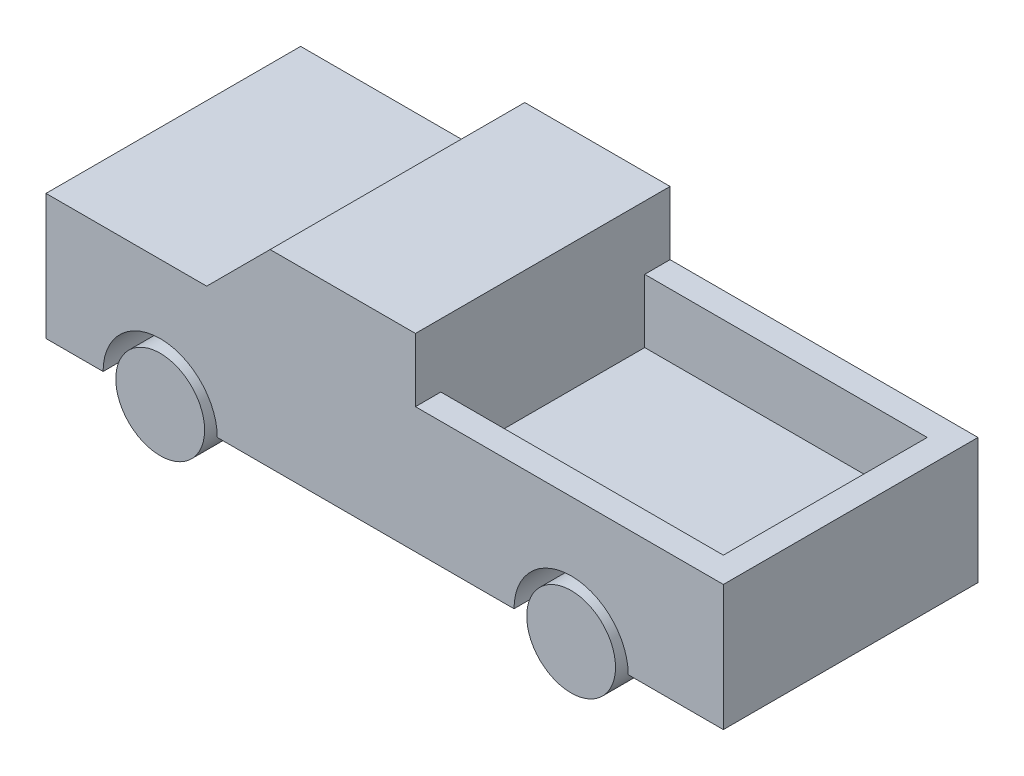
ISO-10303-21;
HEADER;
FILE_DESCRIPTION(('STEP AP214'),'2;1');
FILE_NAME('part.step','',(''),(''),'','','');
FILE_SCHEMA(('AUTOMOTIVE_DESIGN { 1 0 10303 214 1 1 1 1 }'));
ENDSEC;
DATA;
#1=APPLICATION_CONTEXT('core data for automotive mechanical design processes');
#2=APPLICATION_PROTOCOL_DEFINITION('international standard','automotive_design',2000,#1);
#3=PRODUCT_CONTEXT('',#1,'mechanical');
#4=PRODUCT('Part','Part','',(#3));
#5=PRODUCT_RELATED_PRODUCT_CATEGORY('part','',(#4));
#6=PRODUCT_DEFINITION_FORMATION('','',#4);
#7=PRODUCT_DEFINITION_CONTEXT('part definition',#1,'design');
#8=PRODUCT_DEFINITION('design','',#6,#7);
#9=PRODUCT_DEFINITION_SHAPE('','',#8);
#10=(LENGTH_UNIT() NAMED_UNIT(*) SI_UNIT(.MILLI.,.METRE.));
#11=(NAMED_UNIT(*) PLANE_ANGLE_UNIT() SI_UNIT($,.RADIAN.));
#12=(NAMED_UNIT(*) SI_UNIT($,.STERADIAN.) SOLID_ANGLE_UNIT());
#13=UNCERTAINTY_MEASURE_WITH_UNIT(LENGTH_MEASURE(1.E-05),#10,'distance_accuracy_value','');
#14=(GEOMETRIC_REPRESENTATION_CONTEXT(3) GLOBAL_UNCERTAINTY_ASSIGNED_CONTEXT((#13)) GLOBAL_UNIT_ASSIGNED_CONTEXT((#10,
#11,#12)) REPRESENTATION_CONTEXT('',''));
#15=CARTESIAN_POINT('',(0.,0.,0.));
#16=DIRECTION('',(0.,0.,1.));
#17=DIRECTION('',(1.,0.,0.));
#18=AXIS2_PLACEMENT_3D('',#15,#16,#17);
#19=CARTESIAN_POINT('',(4139.,-1491.,2007.));
#20=DIRECTION('',(0.,0.,-1.));
#21=DIRECTION('',(-1.,0.,0.));
#22=AXIS2_PLACEMENT_3D('',#19,#20,#21);
#23=CYLINDRICAL_SURFACE('',#22,349.999999999999);
#24=CARTESIAN_POINT('',(4139.,-1491.,2007.));
#25=DIRECTION('',(0.,0.,1.));
#26=DIRECTION('',(1.,0.,0.));
#27=AXIS2_PLACEMENT_3D('',#24,#25,#26);
#28=CIRCLE('',#27,349.999999999999);
#29=CARTESIAN_POINT('',(4489.,-1491.,2007.));
#30=VERTEX_POINT('',#29);
#31=EDGE_CURVE('E12',#30,#30,#28,.T.);
#32=ORIENTED_EDGE('',*,*,#31,.F.);
#33=EDGE_LOOP('',(#32));
#34=FACE_BOUND('',#33,.T.);
#35=CARTESIAN_POINT('',(4139.,-1491.,0.));
#36=DIRECTION('',(0.,0.,1.));
#37=DIRECTION('',(1.,0.,0.));
#38=AXIS2_PLACEMENT_3D('',#35,#36,#37);
#39=CIRCLE('',#38,349.999999999999);
#40=CARTESIAN_POINT('',(4489.,-1491.,0.));
#41=VERTEX_POINT('',#40);
#42=EDGE_CURVE('E129',#41,#41,#39,.T.);
#43=ORIENTED_EDGE('',*,*,#42,.T.);
#44=EDGE_LOOP('',(#43));
#45=FACE_BOUND('',#44,.T.);
#46=ADVANCED_FACE('F126',(#34,#45),#23,.T.);
#47=CARTESIAN_POINT('',(0.,0.,2007.));
#48=DIRECTION('',(0.,0.,1.));
#49=DIRECTION('',(1.,0.,0.));
#50=AXIS2_PLACEMENT_3D('',#47,#48,#49);
#51=PLANE('',#50);
#52=ORIENTED_EDGE('',*,*,#31,.T.);
#53=EDGE_LOOP('',(#52));
#54=FACE_BOUND('',#53,.T.);
#55=ADVANCED_FACE('F141',(#54),#51,.T.);
#56=CARTESIAN_POINT('',(0.,0.,0.));
#57=DIRECTION('',(0.,0.,1.));
#58=DIRECTION('',(1.,0.,0.));
#59=AXIS2_PLACEMENT_3D('',#56,#57,#58);
#60=PLANE('',#59);
#61=ORIENTED_EDGE('',*,*,#42,.F.);
#62=EDGE_LOOP('',(#61));
#63=FACE_BOUND('',#62,.T.);
#64=ADVANCED_FACE('F139',(#63),#60,.F.);
#65=CLOSED_SHELL('',(#46,#55,#64));
#66=MANIFOLD_SOLID_BREP('B2',#65);
#67=CARTESIAN_POINT('',(900.,-1491.,2007.));
#68=DIRECTION('',(0.,0.,-1.));
#69=DIRECTION('',(-1.,0.,0.));
#70=AXIS2_PLACEMENT_3D('',#67,#68,#69);
#71=CYLINDRICAL_SURFACE('',#70,350.);
#72=CARTESIAN_POINT('',(900.,-1491.,2007.));
#73=DIRECTION('',(0.,0.,1.));
#74=DIRECTION('',(1.,0.,0.));
#75=AXIS2_PLACEMENT_3D('',#72,#73,#74);
#76=CIRCLE('',#75,350.);
#77=CARTESIAN_POINT('',(1250.,-1491.,2007.));
#78=VERTEX_POINT('',#77);
#79=EDGE_CURVE('E125',#78,#78,#76,.T.);
#80=ORIENTED_EDGE('',*,*,#79,.F.);
#81=EDGE_LOOP('',(#80));
#82=FACE_BOUND('',#81,.T.);
#83=CARTESIAN_POINT('',(900.,-1491.,0.));
#84=DIRECTION('',(0.,0.,1.));
#85=DIRECTION('',(1.,0.,0.));
#86=AXIS2_PLACEMENT_3D('',#83,#84,#85);
#87=CIRCLE('',#86,350.);
#88=CARTESIAN_POINT('',(1250.,-1491.,0.));
#89=VERTEX_POINT('',#88);
#90=EDGE_CURVE('E179',#89,#89,#87,.T.);
#91=ORIENTED_EDGE('',*,*,#90,.T.);
#92=EDGE_LOOP('',(#91));
#93=FACE_BOUND('',#92,.T.);
#94=ADVANCED_FACE('F176',(#82,#93),#71,.T.);
#95=CARTESIAN_POINT('',(0.,0.,2007.));
#96=DIRECTION('',(0.,0.,1.));
#97=DIRECTION('',(1.,0.,0.));
#98=AXIS2_PLACEMENT_3D('',#95,#96,#97);
#99=PLANE('',#98);
#100=ORIENTED_EDGE('',*,*,#79,.T.);
#101=EDGE_LOOP('',(#100));
#102=FACE_BOUND('',#101,.T.);
#103=ADVANCED_FACE('F191',(#102),#99,.T.);
#104=CARTESIAN_POINT('',(0.,0.,0.));
#105=DIRECTION('',(0.,0.,1.));
#106=DIRECTION('',(1.,0.,0.));
#107=AXIS2_PLACEMENT_3D('',#104,#105,#106);
#108=PLANE('',#107);
#109=ORIENTED_EDGE('',*,*,#90,.F.);
#110=EDGE_LOOP('',(#109));
#111=FACE_BOUND('',#110,.T.);
#112=ADVANCED_FACE('F189',(#111),#108,.F.);
#113=CLOSED_SHELL('',(#94,#103,#112));
#114=MANIFOLD_SOLID_BREP('B7',#113);
#115=CARTESIAN_POINT('',(4139.,-1491.,2007.));
#116=DIRECTION('',(0.,0.,-1.));
#117=DIRECTION('',(-1.,0.,0.));
#118=AXIS2_PLACEMENT_3D('',#115,#116,#117);
#119=CYLINDRICAL_SURFACE('',#118,450.);
#120=CARTESIAN_POINT('',(4139.,-1491.,0.));
#121=DIRECTION('',(0.,0.,1.));
#122=DIRECTION('',(1.,0.,0.));
#123=AXIS2_PLACEMENT_3D('',#120,#121,#122);
#124=CIRCLE('',#123,450.);
#125=CARTESIAN_POINT('',(4589.,-1491.,0.));
#126=VERTEX_POINT('',#125);
#127=CARTESIAN_POINT('',(3689.,-1491.,0.));
#128=VERTEX_POINT('',#127);
#129=EDGE_CURVE('E352',#126,#128,#124,.T.);
#130=ORIENTED_EDGE('',*,*,#129,.F.);
#131=DIRECTION('',(0.,0.,-1.));
#132=VECTOR('',#131,1.);
#133=CARTESIAN_POINT('',(4589.,-1491.,2007.));
#134=LINE('',#133,#132);
#135=CARTESIAN_POINT('',(4589.,-1491.,2007.));
#136=VERTEX_POINT('',#135);
#137=EDGE_CURVE('E174',#136,#126,#134,.T.);
#138=ORIENTED_EDGE('',*,*,#137,.F.);
#139=CARTESIAN_POINT('',(4139.,-1491.,2007.));
#140=DIRECTION('',(0.,0.,1.));
#141=DIRECTION('',(1.,0.,0.));
#142=AXIS2_PLACEMENT_3D('',#139,#140,#141);
#143=CIRCLE('',#142,450.);
#144=CARTESIAN_POINT('',(3689.,-1491.,2007.));
#145=VERTEX_POINT('',#144);
#146=EDGE_CURVE('E396',#136,#145,#143,.T.);
#147=ORIENTED_EDGE('',*,*,#146,.T.);
#148=DIRECTION('',(0.,0.,-1.));
#149=VECTOR('',#148,1.);
#150=CARTESIAN_POINT('',(3689.,-1491.,2007.));
#151=LINE('',#150,#149);
#152=EDGE_CURVE('E286',#145,#128,#151,.T.);
#153=ORIENTED_EDGE('',*,*,#152,.T.);
#154=EDGE_LOOP('',(#130,#138,#147,#153));
#155=FACE_BOUND('',#154,.T.);
#156=ADVANCED_FACE('F217',(#155),#119,.F.);
#157=CARTESIAN_POINT('',(0.,-1491.,2007.));
#158=DIRECTION('',(0.,1.,0.));
#159=DIRECTION('',(0.,0.,1.));
#160=AXIS2_PLACEMENT_3D('',#157,#158,#159);
#161=PLANE('',#160);
#162=DIRECTION('',(1.,0.,0.));
#163=VECTOR('',#162,1.);
#164=CARTESIAN_POINT('',(0.,-1491.,0.));
#165=LINE('',#164,#163);
#166=CARTESIAN_POINT('',(5339.,-1491.,0.));
#167=VERTEX_POINT('',#166);
#168=EDGE_CURVE('E356',#126,#167,#165,.T.);
#169=ORIENTED_EDGE('',*,*,#168,.T.);
#170=DIRECTION('',(0.,0.,-1.));
#171=VECTOR('',#170,1.);
#172=CARTESIAN_POINT('',(5339.,-1491.,2007.));
#173=LINE('',#172,#171);
#174=CARTESIAN_POINT('',(5339.,-1491.,2007.));
#175=VERTEX_POINT('',#174);
#176=EDGE_CURVE('E225',#175,#167,#173,.T.);
#177=ORIENTED_EDGE('',*,*,#176,.F.);
#178=DIRECTION('',(1.,0.,0.));
#179=VECTOR('',#178,1.);
#180=CARTESIAN_POINT('',(0.,-1491.,2007.));
#181=LINE('',#180,#179);
#182=EDGE_CURVE('E445',#136,#175,#181,.T.);
#183=ORIENTED_EDGE('',*,*,#182,.F.);
#184=ORIENTED_EDGE('',*,*,#137,.T.);
#185=EDGE_LOOP('',(#169,#177,#183,#184));
#186=FACE_BOUND('',#185,.T.);
#187=ADVANCED_FACE('F432',(#186),#161,.F.);
#188=CARTESIAN_POINT('',(5339.,0.,2007.));
#189=DIRECTION('',(1.,0.,0.));
#190=DIRECTION('',(0.,0.,-1.));
#191=AXIS2_PLACEMENT_3D('',#188,#189,#190);
#192=PLANE('',#191);
#193=DIRECTION('',(0.,-1.,0.));
#194=VECTOR('',#193,1.);
#195=CARTESIAN_POINT('',(5339.,0.,0.));
#196=LINE('',#195,#194);
#197=CARTESIAN_POINT('',(5339.,-500.,0.));
#198=VERTEX_POINT('',#197);
#199=EDGE_CURVE('E361',#198,#167,#196,.T.);
#200=ORIENTED_EDGE('',*,*,#199,.F.);
#201=DIRECTION('',(0.,0.,-1.));
#202=VECTOR('',#201,1.);
#203=CARTESIAN_POINT('',(5339.,-500.,2007.));
#204=LINE('',#203,#202);
#205=CARTESIAN_POINT('',(5339.,-500.,2007.));
#206=VERTEX_POINT('',#205);
#207=EDGE_CURVE('E420',#206,#198,#204,.T.);
#208=ORIENTED_EDGE('',*,*,#207,.F.);
#209=DIRECTION('',(0.,-1.,0.));
#210=VECTOR('',#209,1.);
#211=CARTESIAN_POINT('',(5339.,0.,2007.));
#212=LINE('',#211,#210);
#213=EDGE_CURVE('E429',#206,#175,#212,.T.);
#214=ORIENTED_EDGE('',*,*,#213,.T.);
#215=ORIENTED_EDGE('',*,*,#176,.T.);
#216=EDGE_LOOP('',(#200,#208,#214,#215));
#217=FACE_BOUND('',#216,.T.);
#218=ADVANCED_FACE('F427',(#217),#192,.T.);
#219=CARTESIAN_POINT('',(0.,-500.,2007.));
#220=DIRECTION('',(0.,1.,0.));
#221=DIRECTION('',(0.,0.,1.));
#222=AXIS2_PLACEMENT_3D('',#219,#220,#221);
#223=PLANE('',#222);
#224=DIRECTION('',(-1.,0.,0.));
#225=VECTOR('',#224,1.);
#226=CARTESIAN_POINT('',(2911.99688256875,-500.,200.));
#227=LINE('',#226,#225);
#228=CARTESIAN_POINT('',(5139.,-500.,200.));
#229=VERTEX_POINT('',#228);
#230=CARTESIAN_POINT('',(2911.99688256875,-500.,200.));
#231=VERTEX_POINT('',#230);
#232=EDGE_CURVE('E232',#229,#231,#227,.T.);
#233=ORIENTED_EDGE('',*,*,#232,.F.);
#234=DIRECTION('',(0.,0.,-1.));
#235=VECTOR('',#234,1.);
#236=CARTESIAN_POINT('',(5139.,-500.,200.));
#237=LINE('',#236,#235);
#238=CARTESIAN_POINT('',(5139.,-500.,1807.));
#239=VERTEX_POINT('',#238);
#240=EDGE_CURVE('E515',#239,#229,#237,.T.);
#241=ORIENTED_EDGE('',*,*,#240,.F.);
#242=DIRECTION('',(1.,0.,0.));
#243=VECTOR('',#242,1.);
#244=CARTESIAN_POINT('',(2911.99688256875,-500.,1807.));
#245=LINE('',#244,#243);
#246=CARTESIAN_POINT('',(2911.99688256875,-500.,1807.));
#247=VERTEX_POINT('',#246);
#248=EDGE_CURVE('E519',#247,#239,#245,.T.);
#249=ORIENTED_EDGE('',*,*,#248,.F.);
#250=DIRECTION('',(0.,0.,-1.));
#251=VECTOR('',#250,1.);
#252=CARTESIAN_POINT('',(2911.99688256875,-500.,2007.));
#253=LINE('',#252,#251);
#254=CARTESIAN_POINT('',(2911.99688256875,-500.,2007.));
#255=VERTEX_POINT('',#254);
#256=EDGE_CURVE('E416',#255,#247,#253,.T.);
#257=ORIENTED_EDGE('',*,*,#256,.F.);
#258=DIRECTION('',(1.,0.,0.));
#259=VECTOR('',#258,1.);
#260=CARTESIAN_POINT('',(0.,-500.,2007.));
#261=LINE('',#260,#259);
#262=EDGE_CURVE('E442',#255,#206,#261,.T.);
#263=ORIENTED_EDGE('',*,*,#262,.T.);
#264=ORIENTED_EDGE('',*,*,#207,.T.);
#265=DIRECTION('',(1.,0.,0.));
#266=VECTOR('',#265,1.);
#267=CARTESIAN_POINT('',(0.,-500.,0.));
#268=LINE('',#267,#266);
#269=CARTESIAN_POINT('',(2911.99688256875,-500.,0.));
#270=VERTEX_POINT('',#269);
#271=EDGE_CURVE('E365',#270,#198,#268,.T.);
#272=ORIENTED_EDGE('',*,*,#271,.F.);
#273=EDGE_CURVE('E415',#231,#270,#253,.T.);
#274=ORIENTED_EDGE('',*,*,#273,.F.);
#275=EDGE_LOOP('',(#233,#241,#249,#257,#263,#264,#272,#274));
#276=FACE_BOUND('',#275,.T.);
#277=ADVANCED_FACE('F439',(#276),#223,.T.);
#278=CARTESIAN_POINT('',(2911.99688256875,0.,2007.));
#279=DIRECTION('',(1.,0.,0.));
#280=DIRECTION('',(0.,0.,-1.));
#281=AXIS2_PLACEMENT_3D('',#278,#279,#280);
#282=PLANE('',#281);
#283=DIRECTION('',(0.,-1.,0.));
#284=VECTOR('',#283,1.);
#285=CARTESIAN_POINT('',(2911.99688256875,0.,0.));
#286=LINE('',#285,#284);
#287=CARTESIAN_POINT('',(2911.99688256875,0.,0.));
#288=VERTEX_POINT('',#287);
#289=EDGE_CURVE('E369',#288,#270,#286,.T.);
#290=ORIENTED_EDGE('',*,*,#289,.F.);
#291=DIRECTION('',(0.,0.,-1.));
#292=VECTOR('',#291,1.);
#293=CARTESIAN_POINT('',(2911.99688256875,0.,2007.));
#294=LINE('',#293,#292);
#295=CARTESIAN_POINT('',(2911.99688256875,0.,2007.));
#296=VERTEX_POINT('',#295);
#297=EDGE_CURVE('E412',#296,#288,#294,.T.);
#298=ORIENTED_EDGE('',*,*,#297,.F.);
#299=DIRECTION('',(0.,-1.,0.));
#300=VECTOR('',#299,1.);
#301=CARTESIAN_POINT('',(2911.99688256875,0.,2007.));
#302=LINE('',#301,#300);
#303=EDGE_CURVE('E450',#296,#255,#302,.T.);
#304=ORIENTED_EDGE('',*,*,#303,.T.);
#305=ORIENTED_EDGE('',*,*,#256,.T.);
#306=DIRECTION('',(0.,1.,0.));
#307=VECTOR('',#306,1.);
#308=CARTESIAN_POINT('',(2911.99688256875,-1000.,1807.));
#309=LINE('',#308,#307);
#310=CARTESIAN_POINT('',(2911.99688256875,-1000.,1807.));
#311=VERTEX_POINT('',#310);
#312=EDGE_CURVE('E498',#311,#247,#309,.T.);
#313=ORIENTED_EDGE('',*,*,#312,.F.);
#314=DIRECTION('',(0.,0.,1.));
#315=VECTOR('',#314,1.);
#316=CARTESIAN_POINT('',(2911.99688256875,-1000.,200.));
#317=LINE('',#316,#315);
#318=CARTESIAN_POINT('',(2911.99688256875,-1000.,200.));
#319=VERTEX_POINT('',#318);
#320=EDGE_CURVE('E514',#319,#311,#317,.T.);
#321=ORIENTED_EDGE('',*,*,#320,.F.);
#322=DIRECTION('',(0.,1.,0.));
#323=VECTOR('',#322,1.);
#324=CARTESIAN_POINT('',(2911.99688256875,-1000.,200.));
#325=LINE('',#324,#323);
#326=EDGE_CURVE('E357',#319,#231,#325,.T.);
#327=ORIENTED_EDGE('',*,*,#326,.T.);
#328=ORIENTED_EDGE('',*,*,#273,.T.);
#329=EDGE_LOOP('',(#290,#298,#304,#305,#313,#321,#327,#328));
#330=FACE_BOUND('',#329,.T.);
#331=ADVANCED_FACE('F546',(#330),#282,.T.);
#332=CARTESIAN_POINT('',(0.,0.,2007.));
#333=DIRECTION('',(0.,1.,0.));
#334=DIRECTION('',(-1.,0.,0.));
#335=AXIS2_PLACEMENT_3D('',#332,#333,#334);
#336=PLANE('',#335);
#337=DIRECTION('',(1.,0.,0.));
#338=VECTOR('',#337,1.);
#339=CARTESIAN_POINT('',(0.,0.,0.));
#340=LINE('',#339,#338);
#341=CARTESIAN_POINT('',(1766.50347674035,-5.55111512312578E-13,0.));
#342=VERTEX_POINT('',#341);
#343=EDGE_CURVE('E373',#342,#288,#340,.T.);
#344=ORIENTED_EDGE('',*,*,#343,.F.);
#345=DIRECTION('',(0.,0.,-1.));
#346=VECTOR('',#345,1.);
#347=CARTESIAN_POINT('',(1766.50347674035,-5.55111512312578E-13,2007.));
#348=LINE('',#347,#346);
#349=CARTESIAN_POINT('',(1766.50347674035,-5.55111512312578E-13,2007.));
#350=VERTEX_POINT('',#349);
#351=EDGE_CURVE('E409',#350,#342,#348,.T.);
#352=ORIENTED_EDGE('',*,*,#351,.F.);
#353=DIRECTION('',(1.,0.,0.));
#354=VECTOR('',#353,1.);
#355=CARTESIAN_POINT('',(0.,0.,2007.));
#356=LINE('',#355,#354);
#357=EDGE_CURVE('E457',#350,#296,#356,.T.);
#358=ORIENTED_EDGE('',*,*,#357,.T.);
#359=ORIENTED_EDGE('',*,*,#297,.T.);
#360=EDGE_LOOP('',(#344,#352,#358,#359));
#361=FACE_BOUND('',#360,.T.);
#362=ADVANCED_FACE('F564',(#361),#336,.T.);
#363=CARTESIAN_POINT('',(883.251738370176,-883.251738370173,2007.));
#364=DIRECTION('',(-0.707106781186549,0.707106781186546,0.));
#365=DIRECTION('',(-0.707106781186546,-0.707106781186549,0.));
#366=AXIS2_PLACEMENT_3D('',#363,#364,#365);
#367=PLANE('',#366);
#368=DIRECTION('',(0.707106781186546,0.707106781186549,0.));
#369=VECTOR('',#368,1.);
#370=CARTESIAN_POINT('',(883.251738370176,-883.251738370173,0.));
#371=LINE('',#370,#369);
#372=CARTESIAN_POINT('',(1266.50347674035,-500.,0.));
#373=VERTEX_POINT('',#372);
#374=EDGE_CURVE('E377',#373,#342,#371,.T.);
#375=ORIENTED_EDGE('',*,*,#374,.F.);
#376=DIRECTION('',(0.,0.,-1.));
#377=VECTOR('',#376,1.);
#378=CARTESIAN_POINT('',(1266.50347674035,-500.,2007.));
#379=LINE('',#378,#377);
#380=CARTESIAN_POINT('',(1266.50347674035,-500.,2007.));
#381=VERTEX_POINT('',#380);
#382=EDGE_CURVE('E406',#381,#373,#379,.T.);
#383=ORIENTED_EDGE('',*,*,#382,.F.);
#384=DIRECTION('',(0.707106781186546,0.707106781186549,0.));
#385=VECTOR('',#384,1.);
#386=CARTESIAN_POINT('',(883.251738370176,-883.251738370173,2007.));
#387=LINE('',#386,#385);
#388=EDGE_CURVE('E461',#381,#350,#387,.T.);
#389=ORIENTED_EDGE('',*,*,#388,.T.);
#390=ORIENTED_EDGE('',*,*,#351,.T.);
#391=EDGE_LOOP('',(#375,#383,#389,#390));
#392=FACE_BOUND('',#391,.T.);
#393=ADVANCED_FACE('F476',(#392),#367,.T.);
#394=CARTESIAN_POINT('',(0.,-500.,2007.));
#395=DIRECTION('',(0.,1.,0.));
#396=DIRECTION('',(0.,0.,1.));
#397=AXIS2_PLACEMENT_3D('',#394,#395,#396);
#398=PLANE('',#397);
#399=DIRECTION('',(1.,0.,0.));
#400=VECTOR('',#399,1.);
#401=CARTESIAN_POINT('',(0.,-500.,0.));
#402=LINE('',#401,#400);
#403=CARTESIAN_POINT('',(0.,-500.,0.));
#404=VERTEX_POINT('',#403);
#405=EDGE_CURVE('E381',#404,#373,#402,.T.);
#406=ORIENTED_EDGE('',*,*,#405,.F.);
#407=DIRECTION('',(0.,0.,-1.));
#408=VECTOR('',#407,1.);
#409=CARTESIAN_POINT('',(0.,-500.,2007.));
#410=LINE('',#409,#408);
#411=CARTESIAN_POINT('',(0.,-500.,2007.));
#412=VERTEX_POINT('',#411);
#413=EDGE_CURVE('E403',#412,#404,#410,.T.);
#414=ORIENTED_EDGE('',*,*,#413,.F.);
#415=DIRECTION('',(1.,0.,0.));
#416=VECTOR('',#415,1.);
#417=CARTESIAN_POINT('',(0.,-500.,2007.));
#418=LINE('',#417,#416);
#419=EDGE_CURVE('E465',#412,#381,#418,.T.);
#420=ORIENTED_EDGE('',*,*,#419,.T.);
#421=ORIENTED_EDGE('',*,*,#382,.T.);
#422=EDGE_LOOP('',(#406,#414,#420,#421));
#423=FACE_BOUND('',#422,.T.);
#424=ADVANCED_FACE('F471',(#423),#398,.T.);
#425=CARTESIAN_POINT('',(0.,0.,2007.));
#426=DIRECTION('',(1.,0.,0.));
#427=DIRECTION('',(0.,1.,0.));
#428=AXIS2_PLACEMENT_3D('',#425,#426,#427);
#429=PLANE('',#428);
#430=DIRECTION('',(0.,-1.,0.));
#431=VECTOR('',#430,1.);
#432=CARTESIAN_POINT('',(0.,0.,0.));
#433=LINE('',#432,#431);
#434=CARTESIAN_POINT('',(0.,-1491.,0.));
#435=VERTEX_POINT('',#434);
#436=EDGE_CURVE('E385',#404,#435,#433,.T.);
#437=ORIENTED_EDGE('',*,*,#436,.T.);
#438=DIRECTION('',(0.,0.,-1.));
#439=VECTOR('',#438,1.);
#440=CARTESIAN_POINT('',(0.,-1491.,2007.));
#441=LINE('',#440,#439);
#442=CARTESIAN_POINT('',(0.,-1491.,2007.));
#443=VERTEX_POINT('',#442);
#444=EDGE_CURVE('E342',#443,#435,#441,.T.);
#445=ORIENTED_EDGE('',*,*,#444,.F.);
#446=DIRECTION('',(0.,-1.,0.));
#447=VECTOR('',#446,1.);
#448=CARTESIAN_POINT('',(0.,0.,2007.));
#449=LINE('',#448,#447);
#450=EDGE_CURVE('E327',#412,#443,#449,.T.);
#451=ORIENTED_EDGE('',*,*,#450,.F.);
#452=ORIENTED_EDGE('',*,*,#413,.T.);
#453=EDGE_LOOP('',(#437,#445,#451,#452));
#454=FACE_BOUND('',#453,.T.);
#455=ADVANCED_FACE('F480',(#454),#429,.F.);
#456=CARTESIAN_POINT('',(0.,-1491.,2007.));
#457=DIRECTION('',(0.,1.,0.));
#458=DIRECTION('',(0.,0.,1.));
#459=AXIS2_PLACEMENT_3D('',#456,#457,#458);
#460=PLANE('',#459);
#461=DIRECTION('',(1.,0.,0.));
#462=VECTOR('',#461,1.);
#463=CARTESIAN_POINT('',(0.,-1491.,0.));
#464=LINE('',#463,#462);
#465=CARTESIAN_POINT('',(450.,-1491.,0.));
#466=VERTEX_POINT('',#465);
#467=EDGE_CURVE('E337',#435,#466,#464,.T.);
#468=ORIENTED_EDGE('',*,*,#467,.T.);
#469=DIRECTION('',(0.,0.,-1.));
#470=VECTOR('',#469,1.);
#471=CARTESIAN_POINT('',(450.,-1491.,2007.));
#472=LINE('',#471,#470);
#473=CARTESIAN_POINT('',(450.,-1491.,2007.));
#474=VERTEX_POINT('',#473);
#475=EDGE_CURVE('E334',#474,#466,#472,.T.);
#476=ORIENTED_EDGE('',*,*,#475,.F.);
#477=DIRECTION('',(1.,0.,0.));
#478=VECTOR('',#477,1.);
#479=CARTESIAN_POINT('',(0.,-1491.,2007.));
#480=LINE('',#479,#478);
#481=EDGE_CURVE('E320',#443,#474,#480,.T.);
#482=ORIENTED_EDGE('',*,*,#481,.F.);
#483=ORIENTED_EDGE('',*,*,#444,.T.);
#484=EDGE_LOOP('',(#468,#476,#482,#483));
#485=FACE_BOUND('',#484,.T.);
#486=ADVANCED_FACE('F335',(#485),#460,.F.);
#487=CARTESIAN_POINT('',(900.,-1491.,2007.));
#488=DIRECTION('',(0.,0.,-1.));
#489=DIRECTION('',(-1.,0.,0.));
#490=AXIS2_PLACEMENT_3D('',#487,#488,#489);
#491=CYLINDRICAL_SURFACE('',#490,450.);
#492=CARTESIAN_POINT('',(900.,-1491.,0.));
#493=DIRECTION('',(0.,0.,1.));
#494=DIRECTION('',(1.,0.,0.));
#495=AXIS2_PLACEMENT_3D('',#492,#493,#494);
#496=CIRCLE('',#495,450.);
#497=CARTESIAN_POINT('',(1350.,-1491.,0.));
#498=VERTEX_POINT('',#497);
#499=EDGE_CURVE('E390',#498,#466,#496,.T.);
#500=ORIENTED_EDGE('',*,*,#499,.F.);
#501=DIRECTION('',(0.,0.,-1.));
#502=VECTOR('',#501,1.);
#503=CARTESIAN_POINT('',(1350.,-1491.,2007.));
#504=LINE('',#503,#502);
#505=CARTESIAN_POINT('',(1350.,-1491.,2007.));
#506=VERTEX_POINT('',#505);
#507=EDGE_CURVE('E343',#506,#498,#504,.T.);
#508=ORIENTED_EDGE('',*,*,#507,.F.);
#509=CARTESIAN_POINT('',(900.,-1491.,2007.));
#510=DIRECTION('',(0.,0.,1.));
#511=DIRECTION('',(1.,0.,0.));
#512=AXIS2_PLACEMENT_3D('',#509,#510,#511);
#513=CIRCLE('',#512,450.);
#514=EDGE_CURVE('E324',#506,#474,#513,.T.);
#515=ORIENTED_EDGE('',*,*,#514,.T.);
#516=ORIENTED_EDGE('',*,*,#475,.T.);
#517=EDGE_LOOP('',(#500,#508,#515,#516));
#518=FACE_BOUND('',#517,.T.);
#519=ADVANCED_FACE('F345',(#518),#491,.F.);
#520=CARTESIAN_POINT('',(0.,-1491.,2007.));
#521=DIRECTION('',(0.,1.,0.));
#522=DIRECTION('',(0.,0.,1.));
#523=AXIS2_PLACEMENT_3D('',#520,#521,#522);
#524=PLANE('',#523);
#525=DIRECTION('',(1.,0.,0.));
#526=VECTOR('',#525,1.);
#527=CARTESIAN_POINT('',(0.,-1491.,0.));
#528=LINE('',#527,#526);
#529=EDGE_CURVE('E393',#498,#128,#528,.T.);
#530=ORIENTED_EDGE('',*,*,#529,.T.);
#531=ORIENTED_EDGE('',*,*,#152,.F.);
#532=DIRECTION('',(1.,0.,0.));
#533=VECTOR('',#532,1.);
#534=CARTESIAN_POINT('',(0.,-1491.,2007.));
#535=LINE('',#534,#533);
#536=EDGE_CURVE('E241',#506,#145,#535,.T.);
#537=ORIENTED_EDGE('',*,*,#536,.F.);
#538=ORIENTED_EDGE('',*,*,#507,.T.);
#539=EDGE_LOOP('',(#530,#531,#537,#538));
#540=FACE_BOUND('',#539,.T.);
#541=ADVANCED_FACE('F495',(#540),#524,.F.);
#542=CARTESIAN_POINT('',(0.,0.,2007.));
#543=DIRECTION('',(0.,0.,1.));
#544=DIRECTION('',(1.,0.,0.));
#545=AXIS2_PLACEMENT_3D('',#542,#543,#544);
#546=PLANE('',#545);
#547=ORIENTED_EDGE('',*,*,#146,.F.);
#548=ORIENTED_EDGE('',*,*,#182,.T.);
#549=ORIENTED_EDGE('',*,*,#213,.F.);
#550=ORIENTED_EDGE('',*,*,#262,.F.);
#551=ORIENTED_EDGE('',*,*,#303,.F.);
#552=ORIENTED_EDGE('',*,*,#357,.F.);
#553=ORIENTED_EDGE('',*,*,#388,.F.);
#554=ORIENTED_EDGE('',*,*,#419,.F.);
#555=ORIENTED_EDGE('',*,*,#450,.T.);
#556=ORIENTED_EDGE('',*,*,#481,.T.);
#557=ORIENTED_EDGE('',*,*,#514,.F.);
#558=ORIENTED_EDGE('',*,*,#536,.T.);
#559=EDGE_LOOP('',(#547,#548,#549,#550,#551,#552,#553,#554,#555,#556,#557,#558));
#560=FACE_BOUND('',#559,.T.);
#561=ADVANCED_FACE('F322',(#560),#546,.T.);
#562=CARTESIAN_POINT('',(0.,0.,0.));
#563=DIRECTION('',(0.,0.,1.));
#564=DIRECTION('',(1.,0.,0.));
#565=AXIS2_PLACEMENT_3D('',#562,#563,#564);
#566=PLANE('',#565);
#567=ORIENTED_EDGE('',*,*,#129,.T.);
#568=ORIENTED_EDGE('',*,*,#529,.F.);
#569=ORIENTED_EDGE('',*,*,#499,.T.);
#570=ORIENTED_EDGE('',*,*,#467,.F.);
#571=ORIENTED_EDGE('',*,*,#436,.F.);
#572=ORIENTED_EDGE('',*,*,#405,.T.);
#573=ORIENTED_EDGE('',*,*,#374,.T.);
#574=ORIENTED_EDGE('',*,*,#343,.T.);
#575=ORIENTED_EDGE('',*,*,#289,.T.);
#576=ORIENTED_EDGE('',*,*,#271,.T.);
#577=ORIENTED_EDGE('',*,*,#199,.T.);
#578=ORIENTED_EDGE('',*,*,#168,.F.);
#579=EDGE_LOOP('',(#567,#568,#569,#570,#571,#572,#573,#574,#575,#576,#577,#578));
#580=FACE_BOUND('',#579,.T.);
#581=ADVANCED_FACE('F434',(#580),#566,.F.);
#582=CARTESIAN_POINT('',(2911.99688256875,-1000.,200.));
#583=DIRECTION('',(0.,0.,-1.));
#584=DIRECTION('',(-1.,0.,0.));
#585=AXIS2_PLACEMENT_3D('',#582,#583,#584);
#586=PLANE('',#585);
#587=ORIENTED_EDGE('',*,*,#232,.T.);
#588=ORIENTED_EDGE('',*,*,#326,.F.);
#589=DIRECTION('',(-1.,0.,0.));
#590=VECTOR('',#589,1.);
#591=CARTESIAN_POINT('',(2911.99688256875,-1000.,200.));
#592=LINE('',#591,#590);
#593=CARTESIAN_POINT('',(5139.,-1000.,200.));
#594=VERTEX_POINT('',#593);
#595=EDGE_CURVE('E503',#594,#319,#592,.T.);
#596=ORIENTED_EDGE('',*,*,#595,.F.);
#597=DIRECTION('',(0.,1.,0.));
#598=VECTOR('',#597,1.);
#599=CARTESIAN_POINT('',(5139.,-1000.,200.));
#600=LINE('',#599,#598);
#601=EDGE_CURVE('E507',#594,#229,#600,.T.);
#602=ORIENTED_EDGE('',*,*,#601,.T.);
#603=EDGE_LOOP('',(#587,#588,#596,#602));
#604=FACE_BOUND('',#603,.T.);
#605=ADVANCED_FACE('F558',(#604),#586,.F.);
#606=CARTESIAN_POINT('',(5139.,-1000.,200.));
#607=DIRECTION('',(1.,0.,0.));
#608=DIRECTION('',(0.,0.,-1.));
#609=AXIS2_PLACEMENT_3D('',#606,#607,#608);
#610=PLANE('',#609);
#611=ORIENTED_EDGE('',*,*,#240,.T.);
#612=ORIENTED_EDGE('',*,*,#601,.F.);
#613=DIRECTION('',(0.,0.,-1.));
#614=VECTOR('',#613,1.);
#615=CARTESIAN_POINT('',(5139.,-1000.,200.));
#616=LINE('',#615,#614);
#617=CARTESIAN_POINT('',(5139.,-1000.,1807.));
#618=VERTEX_POINT('',#617);
#619=EDGE_CURVE('E526',#618,#594,#616,.T.);
#620=ORIENTED_EDGE('',*,*,#619,.F.);
#621=DIRECTION('',(0.,1.,0.));
#622=VECTOR('',#621,1.);
#623=CARTESIAN_POINT('',(5139.,-1000.,1807.));
#624=LINE('',#623,#622);
#625=EDGE_CURVE('E502',#618,#239,#624,.T.);
#626=ORIENTED_EDGE('',*,*,#625,.T.);
#627=EDGE_LOOP('',(#611,#612,#620,#626));
#628=FACE_BOUND('',#627,.T.);
#629=ADVANCED_FACE('F560',(#628),#610,.F.);
#630=CARTESIAN_POINT('',(2911.99688256875,-1000.,1807.));
#631=DIRECTION('',(0.,0.,1.));
#632=DIRECTION('',(1.,0.,0.));
#633=AXIS2_PLACEMENT_3D('',#630,#631,#632);
#634=PLANE('',#633);
#635=ORIENTED_EDGE('',*,*,#248,.T.);
#636=ORIENTED_EDGE('',*,*,#625,.F.);
#637=DIRECTION('',(1.,0.,0.));
#638=VECTOR('',#637,1.);
#639=CARTESIAN_POINT('',(2911.99688256875,-1000.,1807.));
#640=LINE('',#639,#638);
#641=EDGE_CURVE('E530',#311,#618,#640,.T.);
#642=ORIENTED_EDGE('',*,*,#641,.F.);
#643=ORIENTED_EDGE('',*,*,#312,.T.);
#644=EDGE_LOOP('',(#635,#636,#642,#643));
#645=FACE_BOUND('',#644,.T.);
#646=ADVANCED_FACE('F611',(#645),#634,.F.);
#647=CARTESIAN_POINT('',(0.,-1000.,0.));
#648=DIRECTION('',(0.,1.,0.));
#649=DIRECTION('',(0.,0.,1.));
#650=AXIS2_PLACEMENT_3D('',#647,#648,#649);
#651=PLANE('',#650);
#652=ORIENTED_EDGE('',*,*,#320,.T.);
#653=ORIENTED_EDGE('',*,*,#641,.T.);
#654=ORIENTED_EDGE('',*,*,#619,.T.);
#655=ORIENTED_EDGE('',*,*,#595,.T.);
#656=EDGE_LOOP('',(#652,#653,#654,#655));
#657=FACE_BOUND('',#656,.T.);
#658=ADVANCED_FACE('F539',(#657),#651,.T.);
#659=CLOSED_SHELL('',(#156,#187,#218,#277,#331,#362,#393,#424,#455,#486,#519,#541,#561,#581,
#605,#629,#646,#658));
#660=MANIFOLD_SOLID_BREP('B120',#659);
#661=ADVANCED_BREP_SHAPE_REPRESENTATION('',(#18,#66,#114,#660),#14);
#662=SHAPE_DEFINITION_REPRESENTATION(#9,#661);
ENDSEC;
END-ISO-10303-21;
